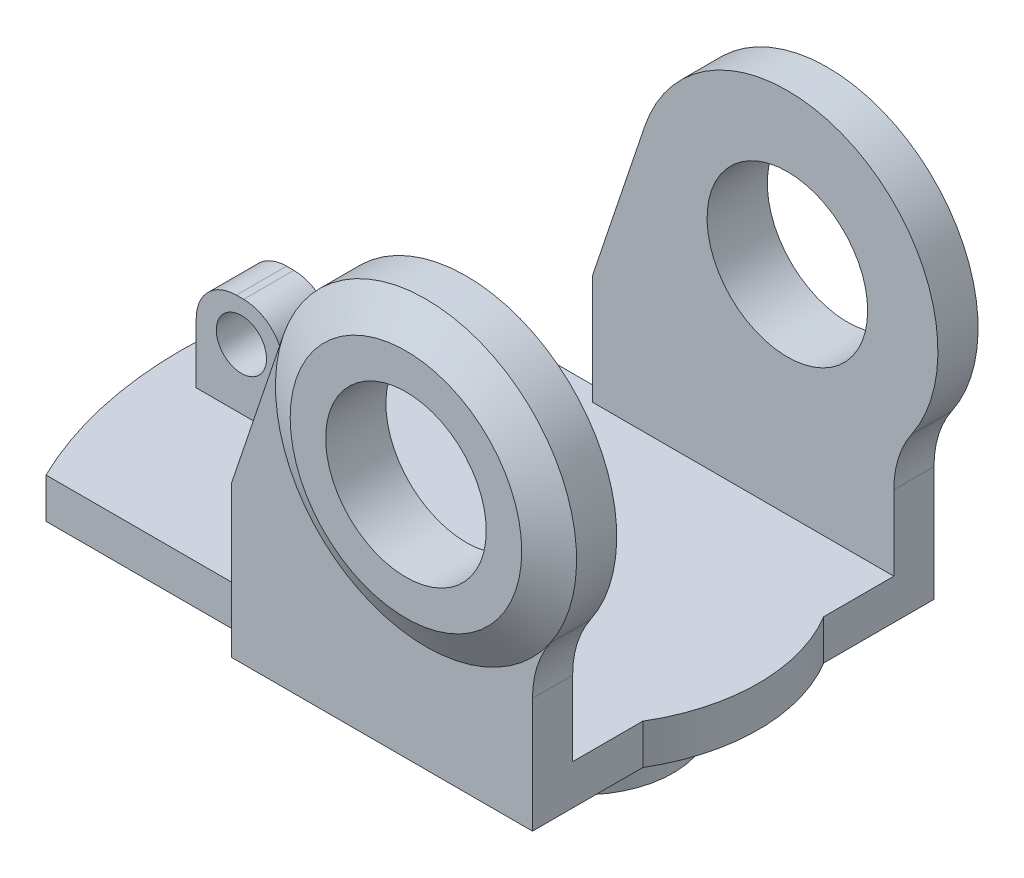
ISO-10303-21;
HEADER;
FILE_DESCRIPTION(('STEP AP214'),'2;1');
FILE_NAME('part.step','',(''),(''),'','','');
FILE_SCHEMA(('AUTOMOTIVE_DESIGN { 1 0 10303 214 1 1 1 1 }'));
ENDSEC;
DATA;
#1=APPLICATION_CONTEXT('core data for automotive mechanical design processes');
#2=APPLICATION_PROTOCOL_DEFINITION('international standard','automotive_design',2000,#1);
#3=PRODUCT_CONTEXT('',#1,'mechanical');
#4=PRODUCT('Part','Part','',(#3));
#5=PRODUCT_RELATED_PRODUCT_CATEGORY('part','',(#4));
#6=PRODUCT_DEFINITION_FORMATION('','',#4);
#7=PRODUCT_DEFINITION_CONTEXT('part definition',#1,'design');
#8=PRODUCT_DEFINITION('design','',#6,#7);
#9=PRODUCT_DEFINITION_SHAPE('','',#8);
#10=(LENGTH_UNIT() NAMED_UNIT(*) SI_UNIT(.MILLI.,.METRE.));
#11=(NAMED_UNIT(*) PLANE_ANGLE_UNIT() SI_UNIT($,.RADIAN.));
#12=(NAMED_UNIT(*) SI_UNIT($,.STERADIAN.) SOLID_ANGLE_UNIT());
#13=UNCERTAINTY_MEASURE_WITH_UNIT(LENGTH_MEASURE(1.E-05),#10,'distance_accuracy_value','');
#14=(GEOMETRIC_REPRESENTATION_CONTEXT(3) GLOBAL_UNCERTAINTY_ASSIGNED_CONTEXT((#13)) GLOBAL_UNIT_ASSIGNED_CONTEXT((#10,
#11,#12)) REPRESENTATION_CONTEXT('',''));
#15=CARTESIAN_POINT('',(0.,0.,0.));
#16=DIRECTION('',(0.,0.,1.));
#17=DIRECTION('',(1.,0.,0.));
#18=AXIS2_PLACEMENT_3D('',#15,#16,#17);
#19=CARTESIAN_POINT('',(-36.,14.,2.5));
#20=DIRECTION('',(0.,0.,-1.));
#21=DIRECTION('',(-1.,0.,0.));
#22=AXIS2_PLACEMENT_3D('',#19,#20,#21);
#23=PLANE('',#22);
#24=CARTESIAN_POINT('',(-31.5,10.,2.5));
#25=DIRECTION('',(0.,0.,1.));
#26=DIRECTION('',(1.,0.,0.));
#27=AXIS2_PLACEMENT_3D('',#24,#25,#26);
#28=CIRCLE('',#27,2.5);
#29=CARTESIAN_POINT('',(-29.,10.,2.5));
#30=VERTEX_POINT('',#29);
#31=EDGE_CURVE('E489',#30,#30,#28,.T.);
#32=ORIENTED_EDGE('',*,*,#31,.F.);
#33=EDGE_LOOP('',(#32));
#34=FACE_BOUND('',#33,.T.);
#35=DIRECTION('',(-0.196116135138184,0.98058067569092,0.));
#36=VECTOR('',#35,1.);
#37=CARTESIAN_POINT('',(-26.,4.,2.5));
#38=LINE('',#37,#36);
#39=CARTESIAN_POINT('',(-26.,4.,2.5));
#40=VERTEX_POINT('',#39);
#41=CARTESIAN_POINT('',(-27.3568929081105,10.7844645405527,2.5));
#42=VERTEX_POINT('',#41);
#43=EDGE_CURVE('E232',#40,#42,#38,.T.);
#44=ORIENTED_EDGE('',*,*,#43,.T.);
#45=CARTESIAN_POINT('',(-31.2792156108742,10.,2.5));
#46=DIRECTION('',(0.,0.,-1.));
#47=DIRECTION('',(-1.,0.,0.));
#48=AXIS2_PLACEMENT_3D('',#45,#46,#47);
#49=CIRCLE('',#48,4.);
#50=CARTESIAN_POINT('',(-31.2792156108742,14.,2.5));
#51=VERTEX_POINT('',#50);
#52=EDGE_CURVE('E82',#42,#51,#49,.F.);
#53=ORIENTED_EDGE('',*,*,#52,.T.);
#54=DIRECTION('',(1.,0.,0.));
#55=VECTOR('',#54,1.);
#56=CARTESIAN_POINT('',(-36.,14.,2.5));
#57=LINE('',#56,#55);
#58=CARTESIAN_POINT('',(-32.,14.,2.5));
#59=VERTEX_POINT('',#58);
#60=EDGE_CURVE('E259',#59,#51,#57,.T.);
#61=ORIENTED_EDGE('',*,*,#60,.F.);
#62=CARTESIAN_POINT('',(-32.,10.,2.5));
#63=DIRECTION('',(0.,0.,-1.));
#64=DIRECTION('',(-1.,0.,0.));
#65=AXIS2_PLACEMENT_3D('',#62,#63,#64);
#66=CIRCLE('',#65,4.);
#67=CARTESIAN_POINT('',(-36.,10.,2.5));
#68=VERTEX_POINT('',#67);
#69=EDGE_CURVE('E89',#59,#68,#66,.F.);
#70=ORIENTED_EDGE('',*,*,#69,.T.);
#71=DIRECTION('',(0.,-1.,0.));
#72=VECTOR('',#71,1.);
#73=CARTESIAN_POINT('',(-36.,14.,2.5));
#74=LINE('',#73,#72);
#75=CARTESIAN_POINT('',(-36.,4.,2.5));
#76=VERTEX_POINT('',#75);
#77=EDGE_CURVE('E252',#68,#76,#74,.T.);
#78=ORIENTED_EDGE('',*,*,#77,.T.);
#79=DIRECTION('',(1.,0.,0.));
#80=VECTOR('',#79,1.);
#81=CARTESIAN_POINT('',(-36.,4.,2.5));
#82=LINE('',#81,#80);
#83=EDGE_CURVE('E247',#76,#40,#82,.T.);
#84=ORIENTED_EDGE('',*,*,#83,.T.);
#85=EDGE_LOOP('',(#44,#53,#61,#70,#78,#84));
#86=FACE_BOUND('',#85,.T.);
#87=ADVANCED_FACE('F73',(#34,#86),#23,.F.);
#88=CARTESIAN_POINT('',(-36.,14.,-2.49999999999999));
#89=DIRECTION('',(0.,0.,1.));
#90=DIRECTION('',(1.,0.,0.));
#91=AXIS2_PLACEMENT_3D('',#88,#89,#90);
#92=PLANE('',#91);
#93=CARTESIAN_POINT('',(-31.5,10.,-2.5));
#94=DIRECTION('',(0.,0.,1.));
#95=DIRECTION('',(1.,0.,0.));
#96=AXIS2_PLACEMENT_3D('',#93,#94,#95);
#97=CIRCLE('',#96,2.5);
#98=CARTESIAN_POINT('',(-29.,10.,-2.5));
#99=VERTEX_POINT('',#98);
#100=EDGE_CURVE('E77',#99,#99,#97,.T.);
#101=ORIENTED_EDGE('',*,*,#100,.T.);
#102=EDGE_LOOP('',(#101));
#103=FACE_BOUND('',#102,.T.);
#104=DIRECTION('',(-1.,0.,0.));
#105=VECTOR('',#104,1.);
#106=CARTESIAN_POINT('',(-36.,14.,-2.49999999999999));
#107=LINE('',#106,#105);
#108=CARTESIAN_POINT('',(-31.2792156108742,14.,-2.5));
#109=VERTEX_POINT('',#108);
#110=CARTESIAN_POINT('',(-32.,14.,-2.5));
#111=VERTEX_POINT('',#110);
#112=EDGE_CURVE('E262',#109,#111,#107,.T.);
#113=ORIENTED_EDGE('',*,*,#112,.F.);
#114=CARTESIAN_POINT('',(-31.2792156108742,10.,-2.5));
#115=DIRECTION('',(0.,0.,1.));
#116=DIRECTION('',(1.,0.,0.));
#117=AXIS2_PLACEMENT_3D('',#114,#115,#116);
#118=CIRCLE('',#117,4.);
#119=CARTESIAN_POINT('',(-27.3568929081105,10.7844645405527,-2.5));
#120=VERTEX_POINT('',#119);
#121=EDGE_CURVE('E433',#109,#120,#118,.F.);
#122=ORIENTED_EDGE('',*,*,#121,.T.);
#123=DIRECTION('',(-0.196116135138184,0.98058067569092,0.));
#124=VECTOR('',#123,1.);
#125=CARTESIAN_POINT('',(-28.3076923076923,15.5384615384615,-2.5));
#126=LINE('',#125,#124);
#127=CARTESIAN_POINT('',(-26.,4.,-2.5));
#128=VERTEX_POINT('',#127);
#129=EDGE_CURVE('E239',#128,#120,#126,.T.);
#130=ORIENTED_EDGE('',*,*,#129,.F.);
#131=DIRECTION('',(-1.,0.,0.));
#132=VECTOR('',#131,1.);
#133=CARTESIAN_POINT('',(-36.,4.,-2.49999999999999));
#134=LINE('',#133,#132);
#135=CARTESIAN_POINT('',(-36.,4.,-2.49999999999999));
#136=VERTEX_POINT('',#135);
#137=EDGE_CURVE('E250',#128,#136,#134,.T.);
#138=ORIENTED_EDGE('',*,*,#137,.T.);
#139=DIRECTION('',(0.,-1.,0.));
#140=VECTOR('',#139,1.);
#141=CARTESIAN_POINT('',(-36.,14.,-2.49999999999999));
#142=LINE('',#141,#140);
#143=CARTESIAN_POINT('',(-36.,10.,-2.49999999999999));
#144=VERTEX_POINT('',#143);
#145=EDGE_CURVE('E260',#144,#136,#142,.T.);
#146=ORIENTED_EDGE('',*,*,#145,.F.);
#147=CARTESIAN_POINT('',(-32.,10.,-2.5));
#148=DIRECTION('',(0.,0.,1.));
#149=DIRECTION('',(1.,0.,0.));
#150=AXIS2_PLACEMENT_3D('',#147,#148,#149);
#151=CIRCLE('',#150,4.);
#152=EDGE_CURVE('E431',#144,#111,#151,.F.);
#153=ORIENTED_EDGE('',*,*,#152,.T.);
#154=EDGE_LOOP('',(#113,#122,#130,#138,#146,#153));
#155=FACE_BOUND('',#154,.T.);
#156=ADVANCED_FACE('F448',(#103,#155),#92,.F.);
#157=CARTESIAN_POINT('',(0.,14.,0.));
#158=DIRECTION('',(0.,1.,0.));
#159=DIRECTION('',(0.,0.,1.));
#160=AXIS2_PLACEMENT_3D('',#157,#158,#159);
#161=PLANE('',#160);
#162=ORIENTED_EDGE('',*,*,#60,.T.);
#163=DIRECTION('',(0.,0.,-1.));
#164=VECTOR('',#163,1.);
#165=CARTESIAN_POINT('',(-31.2792156108742,14.,0.));
#166=LINE('',#165,#164);
#167=EDGE_CURVE('E428',#51,#109,#166,.T.);
#168=ORIENTED_EDGE('',*,*,#167,.T.);
#169=ORIENTED_EDGE('',*,*,#112,.T.);
#170=DIRECTION('',(0.,0.,1.));
#171=VECTOR('',#170,1.);
#172=CARTESIAN_POINT('',(-32.,14.,2.5));
#173=LINE('',#172,#171);
#174=EDGE_CURVE('E425',#111,#59,#173,.T.);
#175=ORIENTED_EDGE('',*,*,#174,.T.);
#176=EDGE_LOOP('',(#162,#168,#169,#175));
#177=FACE_BOUND('',#176,.T.);
#178=ADVANCED_FACE('F441',(#177),#161,.T.);
#179=CARTESIAN_POINT('',(19.3933982822017,4.,-16.));
#180=DIRECTION('',(0.,-1.,0.));
#181=DIRECTION('',(0.,0.,-1.));
#182=AXIS2_PLACEMENT_3D('',#179,#180,#181);
#183=PLANE('',#182);
#184=ORIENTED_EDGE('',*,*,#137,.F.);
#185=DIRECTION('',(0.,0.,-1.));
#186=VECTOR('',#185,1.);
#187=CARTESIAN_POINT('',(-26.,4.,-2.5));
#188=LINE('',#187,#186);
#189=EDGE_CURVE('E235',#40,#128,#188,.T.);
#190=ORIENTED_EDGE('',*,*,#189,.F.);
#191=ORIENTED_EDGE('',*,*,#83,.F.);
#192=DIRECTION('',(0.,0.,1.));
#193=VECTOR('',#192,1.);
#194=CARTESIAN_POINT('',(-36.,4.,-2.49999999999999));
#195=LINE('',#194,#193);
#196=EDGE_CURVE('E253',#136,#76,#195,.T.);
#197=ORIENTED_EDGE('',*,*,#196,.F.);
#198=EDGE_LOOP('',(#184,#190,#191,#197));
#199=FACE_BOUND('',#198,.T.);
#200=DIRECTION('',(0.,0.,-1.));
#201=VECTOR('',#200,1.);
#202=CARTESIAN_POINT('',(15.,4.,-20.));
#203=LINE('',#202,#201);
#204=CARTESIAN_POINT('',(15.,4.,16.));
#205=VERTEX_POINT('',#204);
#206=CARTESIAN_POINT('',(15.,4.,9.01387818865997));
#207=VERTEX_POINT('',#206);
#208=EDGE_CURVE('E412',#205,#207,#203,.T.);
#209=ORIENTED_EDGE('',*,*,#208,.T.);
#210=CARTESIAN_POINT('',(0.,4.,0.));
#211=DIRECTION('',(0.,-1.,0.));
#212=DIRECTION('',(0.,0.,-1.));
#213=AXIS2_PLACEMENT_3D('',#210,#211,#212);
#214=CIRCLE('',#213,17.5);
#215=CARTESIAN_POINT('',(15.,4.,-9.01387818865998));
#216=VERTEX_POINT('',#215);
#217=EDGE_CURVE('E273',#216,#207,#214,.T.);
#218=ORIENTED_EDGE('',*,*,#217,.F.);
#219=CARTESIAN_POINT('',(15.,4.,-16.));
#220=VERTEX_POINT('',#219);
#221=EDGE_CURVE('E407',#216,#220,#203,.T.);
#222=ORIENTED_EDGE('',*,*,#221,.T.);
#223=DIRECTION('',(-1.,0.,0.));
#224=VECTOR('',#223,1.);
#225=CARTESIAN_POINT('',(19.3933982822017,4.,-16.));
#226=LINE('',#225,#224);
#227=CARTESIAN_POINT('',(-15.,4.,-16.));
#228=VERTEX_POINT('',#227);
#229=EDGE_CURVE('E320',#220,#228,#226,.T.);
#230=ORIENTED_EDGE('',*,*,#229,.T.);
#231=DIRECTION('',(0.,0.,-1.));
#232=VECTOR('',#231,1.);
#233=CARTESIAN_POINT('',(-15.,4.,-20.));
#234=LINE('',#233,#232);
#235=CARTESIAN_POINT('',(-15.,4.,-17.5));
#236=VERTEX_POINT('',#235);
#237=EDGE_CURVE('E293',#228,#236,#234,.T.);
#238=ORIENTED_EDGE('',*,*,#237,.T.);
#239=DIRECTION('',(-1.,0.,0.));
#240=VECTOR('',#239,1.);
#241=CARTESIAN_POINT('',(0.,4.,-17.5));
#242=LINE('',#241,#240);
#243=CARTESIAN_POINT('',(-35.9687364248454,4.,-17.5));
#244=VERTEX_POINT('',#243);
#245=EDGE_CURVE('E265',#236,#244,#242,.T.);
#246=ORIENTED_EDGE('',*,*,#245,.T.);
#247=CARTESIAN_POINT('',(0.,4.,0.));
#248=DIRECTION('',(0.,-1.,0.));
#249=DIRECTION('',(0.,0.,-1.));
#250=AXIS2_PLACEMENT_3D('',#247,#248,#249);
#251=CIRCLE('',#250,40.);
#252=CARTESIAN_POINT('',(-35.9687364248454,4.,17.5));
#253=VERTEX_POINT('',#252);
#254=EDGE_CURVE('E267',#253,#244,#251,.T.);
#255=ORIENTED_EDGE('',*,*,#254,.F.);
#256=DIRECTION('',(-1.,0.,0.));
#257=VECTOR('',#256,1.);
#258=CARTESIAN_POINT('',(0.,4.,17.5));
#259=LINE('',#258,#257);
#260=CARTESIAN_POINT('',(-15.,4.,17.5));
#261=VERTEX_POINT('',#260);
#262=EDGE_CURVE('E271',#261,#253,#259,.T.);
#263=ORIENTED_EDGE('',*,*,#262,.F.);
#264=CARTESIAN_POINT('',(-15.,4.,16.));
#265=VERTEX_POINT('',#264);
#266=EDGE_CURVE('E294',#261,#265,#234,.T.);
#267=ORIENTED_EDGE('',*,*,#266,.T.);
#268=DIRECTION('',(-1.,0.,0.));
#269=VECTOR('',#268,1.);
#270=CARTESIAN_POINT('',(19.3933982822017,4.,16.));
#271=LINE('',#270,#269);
#272=EDGE_CURVE('E321',#205,#265,#271,.T.);
#273=ORIENTED_EDGE('',*,*,#272,.F.);
#274=EDGE_LOOP('',(#209,#218,#222,#230,#238,#246,#255,#263,#267,#273));
#275=FACE_BOUND('',#274,.T.);
#276=ADVANCED_FACE('F244',(#199,#275),#183,.F.);
#277=CARTESIAN_POINT('',(-15.,4.,-20.));
#278=DIRECTION('',(1.,0.,0.));
#279=DIRECTION('',(0.,0.,-1.));
#280=AXIS2_PLACEMENT_3D('',#277,#278,#279);
#281=PLANE('',#280);
#282=DIRECTION('',(0.,-1.,0.));
#283=VECTOR('',#282,1.);
#284=CARTESIAN_POINT('',(-15.,4.,-17.5));
#285=LINE('',#284,#283);
#286=CARTESIAN_POINT('',(-15.,0.,-17.5));
#287=VERTEX_POINT('',#286);
#288=EDGE_CURVE('E300',#236,#287,#285,.T.);
#289=ORIENTED_EDGE('',*,*,#288,.F.);
#290=ORIENTED_EDGE('',*,*,#237,.F.);
#291=DIRECTION('',(0.,-1.,0.));
#292=VECTOR('',#291,1.);
#293=CARTESIAN_POINT('',(-15.,42.7338643185126,-16.));
#294=LINE('',#293,#292);
#295=CARTESIAN_POINT('',(-15.,15.,-16.));
#296=VERTEX_POINT('',#295);
#297=EDGE_CURVE('E315',#296,#228,#294,.T.);
#298=ORIENTED_EDGE('',*,*,#297,.F.);
#299=DIRECTION('',(0.,0.,1.));
#300=VECTOR('',#299,1.);
#301=CARTESIAN_POINT('',(-15.,15.,-73.2146779419555));
#302=LINE('',#301,#300);
#303=CARTESIAN_POINT('',(-15.,15.,-20.));
#304=VERTEX_POINT('',#303);
#305=EDGE_CURVE('E349',#304,#296,#302,.T.);
#306=ORIENTED_EDGE('',*,*,#305,.F.);
#307=DIRECTION('',(0.,-1.,0.));
#308=VECTOR('',#307,1.);
#309=CARTESIAN_POINT('',(-15.,4.,-20.));
#310=LINE('',#309,#308);
#311=CARTESIAN_POINT('',(-15.,0.,-20.));
#312=VERTEX_POINT('',#311);
#313=EDGE_CURVE('E394',#304,#312,#310,.T.);
#314=ORIENTED_EDGE('',*,*,#313,.T.);
#315=DIRECTION('',(0.,0.,1.));
#316=VECTOR('',#315,1.);
#317=CARTESIAN_POINT('',(-15.,0.,-20.));
#318=LINE('',#317,#316);
#319=EDGE_CURVE('E382',#312,#287,#318,.T.);
#320=ORIENTED_EDGE('',*,*,#319,.T.);
#321=EDGE_LOOP('',(#289,#290,#298,#306,#314,#320));
#322=FACE_BOUND('',#321,.T.);
#323=ADVANCED_FACE('F514',(#322),#281,.F.);
#324=CARTESIAN_POINT('',(15.,4.,-20.));
#325=DIRECTION('',(1.,0.,0.));
#326=DIRECTION('',(0.,0.,-1.));
#327=AXIS2_PLACEMENT_3D('',#324,#325,#326);
#328=PLANE('',#327);
#329=DIRECTION('',(0.,-1.,0.));
#330=VECTOR('',#329,1.);
#331=CARTESIAN_POINT('',(15.,4.,9.01387818865997));
#332=LINE('',#331,#330);
#333=CARTESIAN_POINT('',(15.,0.,9.01387818865997));
#334=VERTEX_POINT('',#333);
#335=EDGE_CURVE('E290',#207,#334,#332,.T.);
#336=ORIENTED_EDGE('',*,*,#335,.F.);
#337=ORIENTED_EDGE('',*,*,#208,.F.);
#338=DIRECTION('',(0.,-1.,0.));
#339=VECTOR('',#338,1.);
#340=CARTESIAN_POINT('',(15.,4.00000000000001,16.));
#341=LINE('',#340,#339);
#342=CARTESIAN_POINT('',(15.,11.4514625222963,16.));
#343=VERTEX_POINT('',#342);
#344=EDGE_CURVE('E332',#343,#205,#341,.T.);
#345=ORIENTED_EDGE('',*,*,#344,.F.);
#346=DIRECTION('',(0.,0.,1.));
#347=VECTOR('',#346,1.);
#348=CARTESIAN_POINT('',(15.,11.4514625222963,-73.2146779419555));
#349=LINE('',#348,#347);
#350=CARTESIAN_POINT('',(15.,11.4514625222963,20.));
#351=VERTEX_POINT('',#350);
#352=EDGE_CURVE('E365',#343,#351,#349,.T.);
#353=ORIENTED_EDGE('',*,*,#352,.T.);
#354=DIRECTION('',(0.,-1.,0.));
#355=VECTOR('',#354,1.);
#356=CARTESIAN_POINT('',(15.,4.,20.));
#357=LINE('',#356,#355);
#358=CARTESIAN_POINT('',(15.,0.,20.));
#359=VERTEX_POINT('',#358);
#360=EDGE_CURVE('E398',#351,#359,#357,.T.);
#361=ORIENTED_EDGE('',*,*,#360,.T.);
#362=DIRECTION('',(0.,0.,1.));
#363=VECTOR('',#362,1.);
#364=CARTESIAN_POINT('',(15.,0.,-20.));
#365=LINE('',#364,#363);
#366=EDGE_CURVE('E387',#334,#359,#365,.T.);
#367=ORIENTED_EDGE('',*,*,#366,.F.);
#368=EDGE_LOOP('',(#336,#337,#345,#353,#361,#367));
#369=FACE_BOUND('',#368,.T.);
#370=ADVANCED_FACE('F525',(#369),#328,.T.);
#371=CARTESIAN_POINT('',(-15.,4.,-20.));
#372=DIRECTION('',(0.,0.,-1.));
#373=DIRECTION('',(-1.,0.,0.));
#374=AXIS2_PLACEMENT_3D('',#371,#372,#373);
#375=PLANE('',#374);
#376=DIRECTION('',(0.318806134740995,0.947819945164432,0.));
#377=VECTOR('',#376,1.);
#378=CARTESIAN_POINT('',(-15.,15.,-20.));
#379=LINE('',#378,#377);
#380=CARTESIAN_POINT('',(-9.82390089526474,30.3886937389131,-20.));
#381=VERTEX_POINT('',#380);
#382=EDGE_CURVE('E353',#304,#381,#379,.T.);
#383=ORIENTED_EDGE('',*,*,#382,.T.);
#384=CARTESIAN_POINT('',(4.39339828220173,25.6066017177982,-20.));
#385=DIRECTION('',(0.,0.,1.));
#386=DIRECTION('',(1.,0.,0.));
#387=AXIS2_PLACEMENT_3D('',#384,#385,#386);
#388=CIRCLE('',#387,15.);
#389=CARTESIAN_POINT('',(16.7573593128807,17.113518200497,-20.));
#390=VERTEX_POINT('',#389);
#391=EDGE_CURVE('E306',#381,#390,#388,.T.);
#392=ORIENTED_EDGE('',*,*,#391,.T.);
#393=CARTESIAN_POINT('',(25.,11.4514625222963,-20.));
#394=DIRECTION('',(0.,0.,-1.));
#395=DIRECTION('',(-1.,0.,0.));
#396=AXIS2_PLACEMENT_3D('',#393,#394,#395);
#397=CIRCLE('',#396,10.);
#398=CARTESIAN_POINT('',(15.,11.4514625222963,-20.));
#399=VERTEX_POINT('',#398);
#400=EDGE_CURVE('E344',#399,#390,#397,.T.);
#401=ORIENTED_EDGE('',*,*,#400,.F.);
#402=DIRECTION('',(0.,-1.,0.));
#403=VECTOR('',#402,1.);
#404=CARTESIAN_POINT('',(15.,4.,-20.));
#405=LINE('',#404,#403);
#406=CARTESIAN_POINT('',(15.,0.,-20.));
#407=VERTEX_POINT('',#406);
#408=EDGE_CURVE('E396',#399,#407,#405,.T.);
#409=ORIENTED_EDGE('',*,*,#408,.T.);
#410=DIRECTION('',(1.,0.,0.));
#411=VECTOR('',#410,1.);
#412=CARTESIAN_POINT('',(-15.,0.,-20.));
#413=LINE('',#412,#411);
#414=EDGE_CURVE('E391',#312,#407,#413,.T.);
#415=ORIENTED_EDGE('',*,*,#414,.F.);
#416=ORIENTED_EDGE('',*,*,#313,.F.);
#417=EDGE_LOOP('',(#383,#392,#401,#409,#415,#416));
#418=FACE_BOUND('',#417,.T.);
#419=ADVANCED_FACE('F519',(#418),#375,.T.);
#420=CARTESIAN_POINT('',(-15.,4.,20.));
#421=DIRECTION('',(0.,0.,-1.));
#422=DIRECTION('',(-1.,0.,0.));
#423=AXIS2_PLACEMENT_3D('',#420,#421,#422);
#424=PLANE('',#423);
#425=CARTESIAN_POINT('',(4.39339828220173,25.6066017177982,20.));
#426=DIRECTION('',(0.,0.,1.));
#427=DIRECTION('',(1.,0.,0.));
#428=AXIS2_PLACEMENT_3D('',#425,#426,#427);
#429=CIRCLE('',#428,15.);
#430=CARTESIAN_POINT('',(-9.82390089526474,30.3886937389131,20.));
#431=VERTEX_POINT('',#430);
#432=CARTESIAN_POINT('',(16.7573593128807,17.113518200497,20.));
#433=VERTEX_POINT('',#432);
#434=EDGE_CURVE('E312',#431,#433,#429,.T.);
#435=ORIENTED_EDGE('',*,*,#434,.F.);
#436=DIRECTION('',(0.318806134740995,0.947819945164432,0.));
#437=VECTOR('',#436,1.);
#438=CARTESIAN_POINT('',(-15.,15.,20.));
#439=LINE('',#438,#437);
#440=CARTESIAN_POINT('',(-15.,15.,20.));
#441=VERTEX_POINT('',#440);
#442=EDGE_CURVE('E345',#441,#431,#439,.T.);
#443=ORIENTED_EDGE('',*,*,#442,.F.);
#444=DIRECTION('',(0.,-1.,0.));
#445=VECTOR('',#444,1.);
#446=CARTESIAN_POINT('',(-15.,4.,20.));
#447=LINE('',#446,#445);
#448=CARTESIAN_POINT('',(-15.,0.,20.));
#449=VERTEX_POINT('',#448);
#450=EDGE_CURVE('E401',#441,#449,#447,.T.);
#451=ORIENTED_EDGE('',*,*,#450,.T.);
#452=DIRECTION('',(1.,0.,0.));
#453=VECTOR('',#452,1.);
#454=CARTESIAN_POINT('',(-15.,0.,20.));
#455=LINE('',#454,#453);
#456=EDGE_CURVE('E384',#449,#359,#455,.T.);
#457=ORIENTED_EDGE('',*,*,#456,.T.);
#458=ORIENTED_EDGE('',*,*,#360,.F.);
#459=CARTESIAN_POINT('',(25.,11.4514625222963,20.));
#460=DIRECTION('',(0.,0.,-1.));
#461=DIRECTION('',(-1.,0.,0.));
#462=AXIS2_PLACEMENT_3D('',#459,#460,#461);
#463=CIRCLE('',#462,10.);
#464=EDGE_CURVE('E350',#351,#433,#463,.T.);
#465=ORIENTED_EDGE('',*,*,#464,.T.);
#466=EDGE_LOOP('',(#435,#443,#451,#457,#458,#465));
#467=FACE_BOUND('',#466,.T.);
#468=ADVANCED_FACE('F515',(#467),#424,.F.);
#469=CARTESIAN_POINT('',(25.,11.4514625222963,-73.2146779419555));
#470=DIRECTION('',(0.,0.,1.));
#471=DIRECTION('',(1.,0.,0.));
#472=AXIS2_PLACEMENT_3D('',#469,#470,#471);
#473=CYLINDRICAL_SURFACE('',#472,10.);
#474=CARTESIAN_POINT('',(25.,11.4514625222963,-16.));
#475=DIRECTION('',(0.,0.,-1.));
#476=DIRECTION('',(0.,1.,0.));
#477=AXIS2_PLACEMENT_3D('',#474,#475,#476);
#478=CIRCLE('',#477,10.);
#479=CARTESIAN_POINT('',(15.,11.4514625222963,-16.));
#480=VERTEX_POINT('',#479);
#481=CARTESIAN_POINT('',(16.7573593128807,17.113518200497,-16.));
#482=VERTEX_POINT('',#481);
#483=EDGE_CURVE('E340',#480,#482,#478,.T.);
#484=ORIENTED_EDGE('',*,*,#483,.F.);
#485=EDGE_CURVE('E361',#399,#480,#349,.T.);
#486=ORIENTED_EDGE('',*,*,#485,.F.);
#487=ORIENTED_EDGE('',*,*,#400,.T.);
#488=DIRECTION('',(0.,0.,1.));
#489=VECTOR('',#488,1.);
#490=CARTESIAN_POINT('',(16.7573593128807,17.113518200497,-73.2146779419555));
#491=LINE('',#490,#489);
#492=EDGE_CURVE('E370',#390,#482,#491,.T.);
#493=ORIENTED_EDGE('',*,*,#492,.T.);
#494=EDGE_LOOP('',(#484,#486,#487,#493));
#495=FACE_BOUND('',#494,.T.);
#496=ADVANCED_FACE('F518',(#495),#473,.F.);
#497=CARTESIAN_POINT('',(-15.,15.,-73.2146779419555));
#498=DIRECTION('',(0.947819945164432,-0.318806134740995,0.));
#499=DIRECTION('',(0.318806134740995,0.947819945164432,0.));
#500=AXIS2_PLACEMENT_3D('',#497,#498,#499);
#501=PLANE('',#500);
#502=ORIENTED_EDGE('',*,*,#305,.T.);
#503=DIRECTION('',(0.318806134740995,0.947819945164432,0.));
#504=VECTOR('',#503,1.);
#505=CARTESIAN_POINT('',(-15.,15.,-16.));
#506=LINE('',#505,#504);
#507=CARTESIAN_POINT('',(-9.82390089526474,30.3886937389131,-16.));
#508=VERTEX_POINT('',#507);
#509=EDGE_CURVE('E337',#296,#508,#506,.T.);
#510=ORIENTED_EDGE('',*,*,#509,.T.);
#511=DIRECTION('',(0.,0.,1.));
#512=VECTOR('',#511,1.);
#513=CARTESIAN_POINT('',(-9.82390089526474,30.3886937389131,-73.2146779419555));
#514=LINE('',#513,#512);
#515=EDGE_CURVE('E354',#381,#508,#514,.T.);
#516=ORIENTED_EDGE('',*,*,#515,.F.);
#517=ORIENTED_EDGE('',*,*,#382,.F.);
#518=EDGE_LOOP('',(#502,#510,#516,#517));
#519=FACE_BOUND('',#518,.T.);
#520=ADVANCED_FACE('F559',(#519),#501,.F.);
#521=CARTESIAN_POINT('',(4.39339828220173,25.6066017177982,-73.2146779419555));
#522=DIRECTION('',(0.,0.,1.));
#523=DIRECTION('',(1.,0.,0.));
#524=AXIS2_PLACEMENT_3D('',#521,#522,#523);
#525=CYLINDRICAL_SURFACE('',#524,15.);
#526=CARTESIAN_POINT('',(-9.82390089526474,30.3886937389131,16.));
#527=VERTEX_POINT('',#526);
#528=EDGE_CURVE('E348',#527,#431,#514,.T.);
#529=ORIENTED_EDGE('',*,*,#528,.T.);
#530=CARTESIAN_POINT('',(4.39339828220173,25.6066017177982,20.));
#531=DIRECTION('',(0.,0.,1.));
#532=DIRECTION('',(1.,0.,0.));
#533=AXIS2_PLACEMENT_3D('',#530,#531,#532);
#534=CIRCLE('',#533,15.);
#535=EDGE_CURVE('E418',#431,#433,#534,.F.);
#536=ORIENTED_EDGE('',*,*,#535,.T.);
#537=CARTESIAN_POINT('',(16.7573593128807,17.113518200497,16.));
#538=VERTEX_POINT('',#537);
#539=EDGE_CURVE('E357',#538,#433,#491,.T.);
#540=ORIENTED_EDGE('',*,*,#539,.F.);
#541=CARTESIAN_POINT('',(4.39339828220173,25.6066017177982,16.));
#542=DIRECTION('',(0.,0.,1.));
#543=DIRECTION('',(0.,-1.,0.));
#544=AXIS2_PLACEMENT_3D('',#541,#542,#543);
#545=CIRCLE('',#544,15.);
#546=EDGE_CURVE('E325',#527,#538,#545,.F.);
#547=ORIENTED_EDGE('',*,*,#546,.F.);
#548=EDGE_LOOP('',(#529,#536,#540,#547));
#549=FACE_BOUND('',#548,.T.);
#550=ADVANCED_FACE('F563',(#549),#525,.T.);
#551=CARTESIAN_POINT('',(4.39339828220173,25.6066017177982,-73.2146779419555));
#552=DIRECTION('',(0.,0.,1.));
#553=DIRECTION('',(1.,0.,0.));
#554=AXIS2_PLACEMENT_3D('',#551,#552,#553);
#555=CYLINDRICAL_SURFACE('',#554,8.);
#556=CARTESIAN_POINT('',(4.39339828220173,25.6066017177982,-16.));
#557=DIRECTION('',(0.,0.,-1.));
#558=DIRECTION('',(0.,1.,0.));
#559=AXIS2_PLACEMENT_3D('',#556,#557,#558);
#560=CIRCLE('',#559,8.);
#561=CARTESIAN_POINT('',(4.39339828220173,33.6066017177982,-16.));
#562=VERTEX_POINT('',#561);
#563=EDGE_CURVE('E334',#562,#562,#560,.F.);
#564=ORIENTED_EDGE('',*,*,#563,.T.);
#565=EDGE_LOOP('',(#564));
#566=FACE_BOUND('',#565,.T.);
#567=CARTESIAN_POINT('',(4.39339828220173,25.6066017177982,-22.));
#568=DIRECTION('',(0.,0.,1.));
#569=DIRECTION('',(1.,0.,0.));
#570=AXIS2_PLACEMENT_3D('',#567,#568,#569);
#571=CIRCLE('',#570,8.);
#572=CARTESIAN_POINT('',(12.3933982822017,25.6066017177982,-22.));
#573=VERTEX_POINT('',#572);
#574=EDGE_CURVE('E303',#573,#573,#571,.T.);
#575=ORIENTED_EDGE('',*,*,#574,.F.);
#576=EDGE_LOOP('',(#575));
#577=FACE_BOUND('',#576,.T.);
#578=ADVANCED_FACE('F512',(#566,#577),#555,.F.);
#579=ORIENTED_EDGE('',*,*,#266,.F.);
#580=DIRECTION('',(0.,-1.,0.));
#581=VECTOR('',#580,1.);
#582=CARTESIAN_POINT('',(-15.,4.,17.5));
#583=LINE('',#582,#581);
#584=CARTESIAN_POINT('',(-15.,0.,17.5));
#585=VERTEX_POINT('',#584);
#586=EDGE_CURVE('E297',#261,#585,#583,.T.);
#587=ORIENTED_EDGE('',*,*,#586,.T.);
#588=EDGE_CURVE('E379',#585,#449,#318,.T.);
#589=ORIENTED_EDGE('',*,*,#588,.T.);
#590=ORIENTED_EDGE('',*,*,#450,.F.);
#591=CARTESIAN_POINT('',(-15.,15.,16.));
#592=VERTEX_POINT('',#591);
#593=EDGE_CURVE('E364',#592,#441,#302,.T.);
#594=ORIENTED_EDGE('',*,*,#593,.F.);
#595=DIRECTION('',(0.,1.,0.));
#596=VECTOR('',#595,1.);
#597=CARTESIAN_POINT('',(-15.,42.7338643185126,16.));
#598=LINE('',#597,#596);
#599=EDGE_CURVE('E318',#265,#592,#598,.T.);
#600=ORIENTED_EDGE('',*,*,#599,.F.);
#601=EDGE_LOOP('',(#579,#587,#589,#590,#594,#600));
#602=FACE_BOUND('',#601,.T.);
#603=ADVANCED_FACE('F508',(#602),#281,.F.);
#604=DIRECTION('',(0.,-1.,0.));
#605=VECTOR('',#604,1.);
#606=CARTESIAN_POINT('',(15.,4.,-9.01387818865997));
#607=LINE('',#606,#605);
#608=CARTESIAN_POINT('',(15.,0.,-9.01387818865998));
#609=VERTEX_POINT('',#608);
#610=EDGE_CURVE('E288',#609,#216,#607,.F.);
#611=ORIENTED_EDGE('',*,*,#610,.F.);
#612=EDGE_CURVE('E388',#407,#609,#365,.T.);
#613=ORIENTED_EDGE('',*,*,#612,.F.);
#614=ORIENTED_EDGE('',*,*,#408,.F.);
#615=ORIENTED_EDGE('',*,*,#485,.T.);
#616=DIRECTION('',(0.,1.,0.));
#617=VECTOR('',#616,1.);
#618=CARTESIAN_POINT('',(15.,4.,-16.));
#619=LINE('',#618,#617);
#620=EDGE_CURVE('E342',#220,#480,#619,.T.);
#621=ORIENTED_EDGE('',*,*,#620,.F.);
#622=ORIENTED_EDGE('',*,*,#221,.F.);
#623=EDGE_LOOP('',(#611,#613,#614,#615,#621,#622));
#624=FACE_BOUND('',#623,.T.);
#625=ADVANCED_FACE('F511',(#624),#328,.T.);
#626=CARTESIAN_POINT('',(0.,0.,0.));
#627=DIRECTION('',(0.,1.,0.));
#628=DIRECTION('',(0.,0.,1.));
#629=AXIS2_PLACEMENT_3D('',#626,#627,#628);
#630=PLANE('',#629);
#631=ORIENTED_EDGE('',*,*,#588,.F.);
#632=DIRECTION('',(-1.,0.,0.));
#633=VECTOR('',#632,1.);
#634=CARTESIAN_POINT('',(0.,0.,17.5));
#635=LINE('',#634,#633);
#636=CARTESIAN_POINT('',(-35.9687364248454,0.,17.5));
#637=VERTEX_POINT('',#636);
#638=EDGE_CURVE('E280',#585,#637,#635,.T.);
#639=ORIENTED_EDGE('',*,*,#638,.T.);
#640=CARTESIAN_POINT('',(0.,0.,0.));
#641=DIRECTION('',(0.,-1.,0.));
#642=DIRECTION('',(0.,0.,-1.));
#643=AXIS2_PLACEMENT_3D('',#640,#641,#642);
#644=CIRCLE('',#643,40.);
#645=CARTESIAN_POINT('',(-35.9687364248454,0.,-17.5));
#646=VERTEX_POINT('',#645);
#647=EDGE_CURVE('E277',#637,#646,#644,.T.);
#648=ORIENTED_EDGE('',*,*,#647,.T.);
#649=DIRECTION('',(-1.,0.,0.));
#650=VECTOR('',#649,1.);
#651=CARTESIAN_POINT('',(0.,0.,-17.5));
#652=LINE('',#651,#650);
#653=EDGE_CURVE('E264',#287,#646,#652,.T.);
#654=ORIENTED_EDGE('',*,*,#653,.F.);
#655=ORIENTED_EDGE('',*,*,#319,.F.);
#656=ORIENTED_EDGE('',*,*,#414,.T.);
#657=ORIENTED_EDGE('',*,*,#612,.T.);
#658=CARTESIAN_POINT('',(0.,0.,0.));
#659=DIRECTION('',(0.,-1.,0.));
#660=DIRECTION('',(0.,0.,-1.));
#661=AXIS2_PLACEMENT_3D('',#658,#659,#660);
#662=CIRCLE('',#661,17.5);
#663=EDGE_CURVE('E268',#609,#334,#662,.T.);
#664=ORIENTED_EDGE('',*,*,#663,.T.);
#665=ORIENTED_EDGE('',*,*,#366,.T.);
#666=ORIENTED_EDGE('',*,*,#456,.F.);
#667=EDGE_LOOP('',(#631,#639,#648,#654,#655,#656,#657,#664,#665,#666));
#668=FACE_BOUND('',#667,.T.);
#669=CARTESIAN_POINT('',(0.,0.,0.));
#670=DIRECTION('',(0.,1.,0.));
#671=DIRECTION('',(0.,0.,1.));
#672=AXIS2_PLACEMENT_3D('',#669,#670,#671);
#673=CIRCLE('',#672,9.);
#674=CARTESIAN_POINT('',(0.,0.,9.));
#675=VERTEX_POINT('',#674);
#676=EDGE_CURVE('E360',#675,#675,#673,.T.);
#677=ORIENTED_EDGE('',*,*,#676,.T.);
#678=EDGE_LOOP('',(#677));
#679=FACE_BOUND('',#678,.T.);
#680=ADVANCED_FACE('F523',(#668,#679),#630,.F.);
#681=CARTESIAN_POINT('',(0.,-8.,0.));
#682=DIRECTION('',(0.,1.,0.));
#683=DIRECTION('',(0.,0.,1.));
#684=AXIS2_PLACEMENT_3D('',#681,#682,#683);
#685=CYLINDRICAL_SURFACE('',#684,6.);
#686=CARTESIAN_POINT('',(0.,-8.,0.));
#687=DIRECTION('',(0.,1.,0.));
#688=DIRECTION('',(0.,0.,1.));
#689=AXIS2_PLACEMENT_3D('',#686,#687,#688);
#690=CIRCLE('',#689,6.);
#691=CARTESIAN_POINT('',(0.,-8.,6.));
#692=VERTEX_POINT('',#691);
#693=EDGE_CURVE('E373',#692,#692,#690,.T.);
#694=ORIENTED_EDGE('',*,*,#693,.F.);
#695=EDGE_LOOP('',(#694));
#696=FACE_BOUND('',#695,.T.);
#697=CARTESIAN_POINT('',(0.,0.,0.));
#698=DIRECTION('',(0.,1.,0.));
#699=DIRECTION('',(0.,0.,1.));
#700=AXIS2_PLACEMENT_3D('',#697,#698,#699);
#701=CIRCLE('',#700,6.);
#702=CARTESIAN_POINT('',(0.,0.,6.));
#703=VERTEX_POINT('',#702);
#704=EDGE_CURVE('E404',#703,#703,#701,.T.);
#705=ORIENTED_EDGE('',*,*,#704,.T.);
#706=EDGE_LOOP('',(#705));
#707=FACE_BOUND('',#706,.T.);
#708=ADVANCED_FACE('F531',(#696,#707),#685,.F.);
#709=CARTESIAN_POINT('',(0.,-8.,0.));
#710=DIRECTION('',(0.,1.,0.));
#711=DIRECTION('',(0.,0.,1.));
#712=AXIS2_PLACEMENT_3D('',#709,#710,#711);
#713=CYLINDRICAL_SURFACE('',#712,9.);
#714=CARTESIAN_POINT('',(0.,-8.,0.));
#715=DIRECTION('',(0.,1.,0.));
#716=DIRECTION('',(0.,0.,1.));
#717=AXIS2_PLACEMENT_3D('',#714,#715,#716);
#718=CIRCLE('',#717,9.);
#719=CARTESIAN_POINT('',(0.,-8.,9.));
#720=VERTEX_POINT('',#719);
#721=EDGE_CURVE('E376',#720,#720,#718,.T.);
#722=ORIENTED_EDGE('',*,*,#721,.T.);
#723=EDGE_LOOP('',(#722));
#724=FACE_BOUND('',#723,.T.);
#725=ORIENTED_EDGE('',*,*,#676,.F.);
#726=EDGE_LOOP('',(#725));
#727=FACE_BOUND('',#726,.T.);
#728=ADVANCED_FACE('F536',(#724,#727),#713,.T.);
#729=CARTESIAN_POINT('',(0.,-8.,0.));
#730=DIRECTION('',(0.,1.,0.));
#731=DIRECTION('',(0.,0.,1.));
#732=AXIS2_PLACEMENT_3D('',#729,#730,#731);
#733=PLANE('',#732);
#734=ORIENTED_EDGE('',*,*,#693,.T.);
#735=EDGE_LOOP('',(#734));
#736=FACE_BOUND('',#735,.T.);
#737=ORIENTED_EDGE('',*,*,#721,.F.);
#738=EDGE_LOOP('',(#737));
#739=FACE_BOUND('',#738,.T.);
#740=ADVANCED_FACE('F540',(#736,#739),#733,.F.);
#741=ORIENTED_EDGE('',*,*,#704,.F.);
#742=EDGE_LOOP('',(#741));
#743=FACE_BOUND('',#742,.T.);
#744=ADVANCED_FACE('F533',(#743),#630,.F.);
#745=CARTESIAN_POINT('',(25.,11.4514625222963,16.));
#746=DIRECTION('',(0.,0.,1.));
#747=DIRECTION('',(0.,-1.,0.));
#748=AXIS2_PLACEMENT_3D('',#745,#746,#747);
#749=CIRCLE('',#748,10.);
#750=EDGE_CURVE('E330',#538,#343,#749,.T.);
#751=ORIENTED_EDGE('',*,*,#750,.F.);
#752=ORIENTED_EDGE('',*,*,#539,.T.);
#753=ORIENTED_EDGE('',*,*,#464,.F.);
#754=ORIENTED_EDGE('',*,*,#352,.F.);
#755=EDGE_LOOP('',(#751,#752,#753,#754));
#756=FACE_BOUND('',#755,.T.);
#757=ADVANCED_FACE('F551',(#756),#473,.F.);
#758=ORIENTED_EDGE('',*,*,#528,.F.);
#759=DIRECTION('',(-0.318806134740995,-0.947819945164432,0.));
#760=VECTOR('',#759,1.);
#761=CARTESIAN_POINT('',(-15.,15.,16.));
#762=LINE('',#761,#760);
#763=EDGE_CURVE('E327',#527,#592,#762,.T.);
#764=ORIENTED_EDGE('',*,*,#763,.T.);
#765=ORIENTED_EDGE('',*,*,#593,.T.);
#766=ORIENTED_EDGE('',*,*,#442,.T.);
#767=EDGE_LOOP('',(#758,#764,#765,#766));
#768=FACE_BOUND('',#767,.T.);
#769=ADVANCED_FACE('F554',(#768),#501,.F.);
#770=ORIENTED_EDGE('',*,*,#492,.F.);
#771=CARTESIAN_POINT('',(4.39339828220173,25.6066017177982,-20.));
#772=DIRECTION('',(0.,0.,-1.));
#773=DIRECTION('',(-1.,0.,0.));
#774=AXIS2_PLACEMENT_3D('',#771,#772,#773);
#775=CIRCLE('',#774,15.);
#776=EDGE_CURVE('E420',#390,#381,#775,.F.);
#777=ORIENTED_EDGE('',*,*,#776,.T.);
#778=ORIENTED_EDGE('',*,*,#515,.T.);
#779=CARTESIAN_POINT('',(4.39339828220173,25.6066017177982,-16.));
#780=DIRECTION('',(0.,0.,-1.));
#781=DIRECTION('',(0.,1.,0.));
#782=AXIS2_PLACEMENT_3D('',#779,#780,#781);
#783=CIRCLE('',#782,15.);
#784=EDGE_CURVE('E335',#482,#508,#783,.F.);
#785=ORIENTED_EDGE('',*,*,#784,.F.);
#786=EDGE_LOOP('',(#770,#777,#778,#785));
#787=FACE_BOUND('',#786,.T.);
#788=ADVANCED_FACE('F549',(#787),#525,.T.);
#789=CARTESIAN_POINT('',(4.39339828220173,25.6066017177982,16.));
#790=DIRECTION('',(0.,0.,1.));
#791=DIRECTION('',(0.,-1.,0.));
#792=AXIS2_PLACEMENT_3D('',#789,#790,#791);
#793=CIRCLE('',#792,8.);
#794=CARTESIAN_POINT('',(4.39339828220173,17.6066017177982,16.));
#795=VERTEX_POINT('',#794);
#796=EDGE_CURVE('E323',#795,#795,#793,.F.);
#797=ORIENTED_EDGE('',*,*,#796,.T.);
#798=EDGE_LOOP('',(#797));
#799=FACE_BOUND('',#798,.T.);
#800=CARTESIAN_POINT('',(4.39339828220173,25.6066017177982,22.));
#801=DIRECTION('',(0.,0.,1.));
#802=DIRECTION('',(1.,0.,0.));
#803=AXIS2_PLACEMENT_3D('',#800,#801,#802);
#804=CIRCLE('',#803,8.);
#805=CARTESIAN_POINT('',(12.3933982822017,25.6066017177982,22.));
#806=VERTEX_POINT('',#805);
#807=EDGE_CURVE('E309',#806,#806,#804,.T.);
#808=ORIENTED_EDGE('',*,*,#807,.T.);
#809=EDGE_LOOP('',(#808));
#810=FACE_BOUND('',#809,.T.);
#811=ADVANCED_FACE('F545',(#799,#810),#555,.F.);
#812=CARTESIAN_POINT('',(19.3933982822017,42.7338643185126,-16.));
#813=DIRECTION('',(0.,0.,-1.));
#814=DIRECTION('',(0.,1.,0.));
#815=AXIS2_PLACEMENT_3D('',#812,#813,#814);
#816=PLANE('',#815);
#817=ORIENTED_EDGE('',*,*,#620,.T.);
#818=ORIENTED_EDGE('',*,*,#483,.T.);
#819=ORIENTED_EDGE('',*,*,#784,.T.);
#820=ORIENTED_EDGE('',*,*,#509,.F.);
#821=ORIENTED_EDGE('',*,*,#297,.T.);
#822=ORIENTED_EDGE('',*,*,#229,.F.);
#823=EDGE_LOOP('',(#817,#818,#819,#820,#821,#822));
#824=FACE_BOUND('',#823,.T.);
#825=ORIENTED_EDGE('',*,*,#563,.F.);
#826=EDGE_LOOP('',(#825));
#827=FACE_BOUND('',#826,.T.);
#828=ADVANCED_FACE('F548',(#824,#827),#816,.F.);
#829=CARTESIAN_POINT('',(19.3933982822017,42.7338643185126,16.));
#830=DIRECTION('',(0.,0.,1.));
#831=DIRECTION('',(0.,-1.,0.));
#832=AXIS2_PLACEMENT_3D('',#829,#830,#831);
#833=PLANE('',#832);
#834=ORIENTED_EDGE('',*,*,#344,.T.);
#835=ORIENTED_EDGE('',*,*,#272,.T.);
#836=ORIENTED_EDGE('',*,*,#599,.T.);
#837=ORIENTED_EDGE('',*,*,#763,.F.);
#838=ORIENTED_EDGE('',*,*,#546,.T.);
#839=ORIENTED_EDGE('',*,*,#750,.T.);
#840=EDGE_LOOP('',(#834,#835,#836,#837,#838,#839));
#841=FACE_BOUND('',#840,.T.);
#842=ORIENTED_EDGE('',*,*,#796,.F.);
#843=EDGE_LOOP('',(#842));
#844=FACE_BOUND('',#843,.T.);
#845=ADVANCED_FACE('F566',(#841,#844),#833,.F.);
#846=CARTESIAN_POINT('',(4.39339828220173,25.6066017177982,22.));
#847=DIRECTION('',(0.,0.,1.));
#848=DIRECTION('',(1.,0.,0.));
#849=AXIS2_PLACEMENT_3D('',#846,#847,#848);
#850=PLANE('',#849);
#851=CARTESIAN_POINT('',(4.39339828220173,25.6066017177982,22.));
#852=DIRECTION('',(0.,0.,1.));
#853=DIRECTION('',(1.,0.,0.));
#854=AXIS2_PLACEMENT_3D('',#851,#852,#853);
#855=CIRCLE('',#854,11.5358983848623);
#856=CARTESIAN_POINT('',(15.929296667064,25.6066017177982,22.));
#857=VERTEX_POINT('',#856);
#858=EDGE_CURVE('E415',#857,#857,#855,.T.);
#859=ORIENTED_EDGE('',*,*,#858,.T.);
#860=EDGE_LOOP('',(#859));
#861=FACE_BOUND('',#860,.T.);
#862=ORIENTED_EDGE('',*,*,#807,.F.);
#863=EDGE_LOOP('',(#862));
#864=FACE_BOUND('',#863,.T.);
#865=ADVANCED_FACE('F572',(#861,#864),#850,.T.);
#866=CARTESIAN_POINT('',(4.39339828220173,25.6066017177982,-22.));
#867=DIRECTION('',(0.,0.,-1.));
#868=DIRECTION('',(1.,0.,0.));
#869=AXIS2_PLACEMENT_3D('',#866,#867,#868);
#870=PLANE('',#869);
#871=CARTESIAN_POINT('',(4.39339828220173,25.6066017177982,-22.));
#872=DIRECTION('',(0.,0.,-1.));
#873=DIRECTION('',(-1.,0.,0.));
#874=AXIS2_PLACEMENT_3D('',#871,#872,#873);
#875=CIRCLE('',#874,11.5358983848622);
#876=CARTESIAN_POINT('',(-7.14250010266047,25.6066017177982,-22.));
#877=VERTEX_POINT('',#876);
#878=EDGE_CURVE('E422',#877,#877,#875,.T.);
#879=ORIENTED_EDGE('',*,*,#878,.T.);
#880=EDGE_LOOP('',(#879));
#881=FACE_BOUND('',#880,.T.);
#882=ORIENTED_EDGE('',*,*,#574,.T.);
#883=EDGE_LOOP('',(#882));
#884=FACE_BOUND('',#883,.T.);
#885=ADVANCED_FACE('F506',(#881,#884),#870,.T.);
#886=CARTESIAN_POINT('',(4.39339828220173,25.6066017177982,22.));
#887=DIRECTION('',(0.,0.,-1.));
#888=DIRECTION('',(-1.,0.,0.));
#889=AXIS2_PLACEMENT_3D('',#886,#887,#888);
#890=CONICAL_SURFACE('',#889,11.5358983848622,1.0471975511966);
#891=ORIENTED_EDGE('',*,*,#535,.F.);
#892=ORIENTED_EDGE('',*,*,#434,.T.);
#893=EDGE_LOOP('',(#891,#892));
#894=FACE_BOUND('',#893,.T.);
#895=ORIENTED_EDGE('',*,*,#858,.F.);
#896=EDGE_LOOP('',(#895));
#897=FACE_BOUND('',#896,.T.);
#898=ADVANCED_FACE('F502',(#894,#897),#890,.T.);
#899=CARTESIAN_POINT('',(4.39339828220173,25.6066017177982,-20.));
#900=DIRECTION('',(0.,0.,1.));
#901=DIRECTION('',(1.,0.,0.));
#902=AXIS2_PLACEMENT_3D('',#899,#900,#901);
#903=CONICAL_SURFACE('',#902,15.,1.0471975511966);
#904=ORIENTED_EDGE('',*,*,#878,.F.);
#905=EDGE_LOOP('',(#904));
#906=FACE_BOUND('',#905,.T.);
#907=ORIENTED_EDGE('',*,*,#776,.F.);
#908=ORIENTED_EDGE('',*,*,#391,.F.);
#909=EDGE_LOOP('',(#907,#908));
#910=FACE_BOUND('',#909,.T.);
#911=ADVANCED_FACE('F498',(#906,#910),#903,.T.);
#912=CARTESIAN_POINT('',(0.,4.,0.));
#913=DIRECTION('',(0.,-1.,0.));
#914=DIRECTION('',(0.,0.,-1.));
#915=AXIS2_PLACEMENT_3D('',#912,#913,#914);
#916=CYLINDRICAL_SURFACE('',#915,17.5);
#917=ORIENTED_EDGE('',*,*,#217,.T.);
#918=ORIENTED_EDGE('',*,*,#335,.T.);
#919=ORIENTED_EDGE('',*,*,#663,.F.);
#920=ORIENTED_EDGE('',*,*,#610,.T.);
#921=EDGE_LOOP('',(#917,#918,#919,#920));
#922=FACE_BOUND('',#921,.T.);
#923=ADVANCED_FACE('F501',(#922),#916,.T.);
#924=CARTESIAN_POINT('',(0.,4.,-17.5));
#925=DIRECTION('',(0.,0.,1.));
#926=DIRECTION('',(1.,0.,0.));
#927=AXIS2_PLACEMENT_3D('',#924,#925,#926);
#928=PLANE('',#927);
#929=ORIENTED_EDGE('',*,*,#245,.F.);
#930=ORIENTED_EDGE('',*,*,#288,.T.);
#931=ORIENTED_EDGE('',*,*,#653,.T.);
#932=DIRECTION('',(0.,-1.,0.));
#933=VECTOR('',#932,1.);
#934=CARTESIAN_POINT('',(-35.9687364248454,4.,-17.5));
#935=LINE('',#934,#933);
#936=EDGE_CURVE('E285',#244,#646,#935,.T.);
#937=ORIENTED_EDGE('',*,*,#936,.F.);
#938=EDGE_LOOP('',(#929,#930,#931,#937));
#939=FACE_BOUND('',#938,.T.);
#940=ADVANCED_FACE('F580',(#939),#928,.F.);
#941=CARTESIAN_POINT('',(0.,4.,17.5));
#942=DIRECTION('',(0.,0.,1.));
#943=DIRECTION('',(1.,0.,0.));
#944=AXIS2_PLACEMENT_3D('',#941,#942,#943);
#945=PLANE('',#944);
#946=ORIENTED_EDGE('',*,*,#586,.F.);
#947=ORIENTED_EDGE('',*,*,#262,.T.);
#948=DIRECTION('',(0.,-1.,0.));
#949=VECTOR('',#948,1.);
#950=CARTESIAN_POINT('',(-35.9687364248454,4.,17.5));
#951=LINE('',#950,#949);
#952=EDGE_CURVE('E275',#253,#637,#951,.T.);
#953=ORIENTED_EDGE('',*,*,#952,.T.);
#954=ORIENTED_EDGE('',*,*,#638,.F.);
#955=EDGE_LOOP('',(#946,#947,#953,#954));
#956=FACE_BOUND('',#955,.T.);
#957=ADVANCED_FACE('F465',(#956),#945,.T.);
#958=CARTESIAN_POINT('',(0.,4.,0.));
#959=DIRECTION('',(0.,-1.,0.));
#960=DIRECTION('',(0.,0.,-1.));
#961=AXIS2_PLACEMENT_3D('',#958,#959,#960);
#962=CYLINDRICAL_SURFACE('',#961,40.);
#963=ORIENTED_EDGE('',*,*,#647,.F.);
#964=ORIENTED_EDGE('',*,*,#952,.F.);
#965=ORIENTED_EDGE('',*,*,#254,.T.);
#966=ORIENTED_EDGE('',*,*,#936,.T.);
#967=EDGE_LOOP('',(#963,#964,#965,#966));
#968=FACE_BOUND('',#967,.T.);
#969=ADVANCED_FACE('F458',(#968),#962,.T.);
#970=CARTESIAN_POINT('',(-36.,14.,-2.49999999999999));
#971=DIRECTION('',(1.,0.,0.));
#972=DIRECTION('',(0.,0.,-1.));
#973=AXIS2_PLACEMENT_3D('',#970,#971,#972);
#974=PLANE('',#973);
#975=ORIENTED_EDGE('',*,*,#77,.F.);
#976=DIRECTION('',(0.,0.,1.));
#977=VECTOR('',#976,1.);
#978=CARTESIAN_POINT('',(-36.,10.,-2.49999999999999));
#979=LINE('',#978,#977);
#980=EDGE_CURVE('E12',#68,#144,#979,.F.);
#981=ORIENTED_EDGE('',*,*,#980,.T.);
#982=ORIENTED_EDGE('',*,*,#145,.T.);
#983=ORIENTED_EDGE('',*,*,#196,.T.);
#984=EDGE_LOOP('',(#975,#981,#982,#983));
#985=FACE_BOUND('',#984,.T.);
#986=ADVANCED_FACE('F456',(#985),#974,.F.);
#987=CARTESIAN_POINT('',(-26.,4.,-7.5));
#988=DIRECTION('',(0.98058067569092,0.196116135138184,0.));
#989=DIRECTION('',(-0.196116135138184,0.98058067569092,0.));
#990=AXIS2_PLACEMENT_3D('',#987,#988,#989);
#991=PLANE('',#990);
#992=ORIENTED_EDGE('',*,*,#129,.T.);
#993=DIRECTION('',(0.,0.,-1.));
#994=VECTOR('',#993,1.);
#995=CARTESIAN_POINT('',(-27.3568929081105,10.7844645405527,-7.5));
#996=LINE('',#995,#994);
#997=EDGE_CURVE('E97',#120,#42,#996,.F.);
#998=ORIENTED_EDGE('',*,*,#997,.T.);
#999=ORIENTED_EDGE('',*,*,#43,.F.);
#1000=ORIENTED_EDGE('',*,*,#189,.T.);
#1001=EDGE_LOOP('',(#992,#998,#999,#1000));
#1002=FACE_BOUND('',#1001,.T.);
#1003=ADVANCED_FACE('F234',(#1002),#991,.T.);
#1004=CARTESIAN_POINT('',(-31.2792156108742,10.,0.));
#1005=DIRECTION('',(0.,0.,-1.));
#1006=DIRECTION('',(-1.,0.,0.));
#1007=AXIS2_PLACEMENT_3D('',#1004,#1005,#1006);
#1008=CYLINDRICAL_SURFACE('',#1007,4.);
#1009=ORIENTED_EDGE('',*,*,#52,.F.);
#1010=ORIENTED_EDGE('',*,*,#997,.F.);
#1011=ORIENTED_EDGE('',*,*,#121,.F.);
#1012=ORIENTED_EDGE('',*,*,#167,.F.);
#1013=EDGE_LOOP('',(#1009,#1010,#1011,#1012));
#1014=FACE_BOUND('',#1013,.T.);
#1015=ADVANCED_FACE('F446',(#1014),#1008,.T.);
#1016=CARTESIAN_POINT('',(-32.,10.,0.));
#1017=DIRECTION('',(0.,0.,-1.));
#1018=DIRECTION('',(-1.,0.,0.));
#1019=AXIS2_PLACEMENT_3D('',#1016,#1017,#1018);
#1020=CYLINDRICAL_SURFACE('',#1019,4.);
#1021=ORIENTED_EDGE('',*,*,#152,.F.);
#1022=ORIENTED_EDGE('',*,*,#980,.F.);
#1023=ORIENTED_EDGE('',*,*,#69,.F.);
#1024=ORIENTED_EDGE('',*,*,#174,.F.);
#1025=EDGE_LOOP('',(#1021,#1022,#1023,#1024));
#1026=FACE_BOUND('',#1025,.T.);
#1027=ADVANCED_FACE('F75',(#1026),#1020,.T.);
#1028=CARTESIAN_POINT('',(-31.5,10.,-7.5));
#1029=DIRECTION('',(0.,0.,1.));
#1030=DIRECTION('',(1.,0.,0.));
#1031=AXIS2_PLACEMENT_3D('',#1028,#1029,#1030);
#1032=CYLINDRICAL_SURFACE('',#1031,2.5);
#1033=ORIENTED_EDGE('',*,*,#31,.T.);
#1034=EDGE_LOOP('',(#1033));
#1035=FACE_BOUND('',#1034,.T.);
#1036=ORIENTED_EDGE('',*,*,#100,.F.);
#1037=EDGE_LOOP('',(#1036));
#1038=FACE_BOUND('',#1037,.T.);
#1039=ADVANCED_FACE('F481',(#1035,#1038),#1032,.F.);
#1040=CLOSED_SHELL('',(#87,#156,#178,#276,#323,#370,#419,#468,#496,#520,#550,#578,#603,#625,
#680,#708,#728,#740,#744,#757,#769,#788,#811,#828,#845,#865,#885,#898,#911,#923,#940,#957,#969,
#986,#1003,#1015,#1027,#1039));
#1041=MANIFOLD_SOLID_BREP('B2',#1040);
#1042=ADVANCED_BREP_SHAPE_REPRESENTATION('',(#18,#1041),#14);
#1043=SHAPE_DEFINITION_REPRESENTATION(#9,#1042);
ENDSEC;
END-ISO-10303-21;
